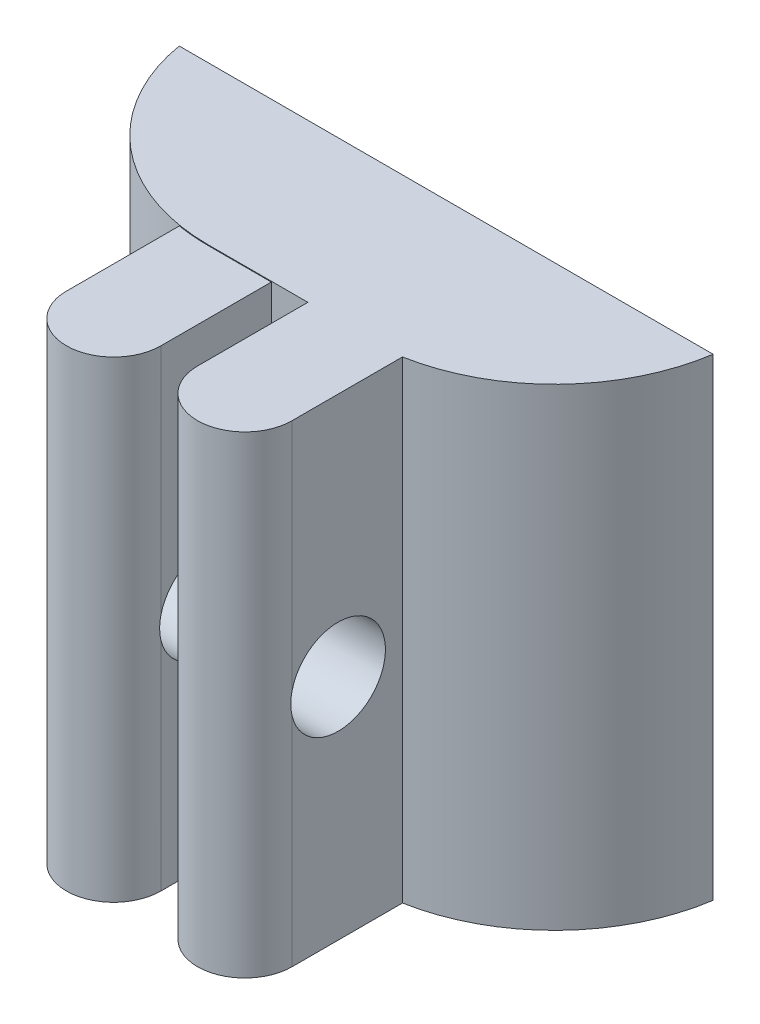
ISO-10303-21;
HEADER;
FILE_DESCRIPTION(('STEP AP214'),'2;1');
FILE_NAME('part.step','',(''),(''),'','','');
FILE_SCHEMA(('AUTOMOTIVE_DESIGN { 1 0 10303 214 1 1 1 1 }'));
ENDSEC;
DATA;
#1=APPLICATION_CONTEXT('core data for automotive mechanical design processes');
#2=APPLICATION_PROTOCOL_DEFINITION('international standard','automotive_design',2000,#1);
#3=PRODUCT_CONTEXT('',#1,'mechanical');
#4=PRODUCT('Part','Part','',(#3));
#5=PRODUCT_RELATED_PRODUCT_CATEGORY('part','',(#4));
#6=PRODUCT_DEFINITION_FORMATION('','',#4);
#7=PRODUCT_DEFINITION_CONTEXT('part definition',#1,'design');
#8=PRODUCT_DEFINITION('design','',#6,#7);
#9=PRODUCT_DEFINITION_SHAPE('','',#8);
#10=(LENGTH_UNIT() NAMED_UNIT(*) SI_UNIT(.MILLI.,.METRE.));
#11=(NAMED_UNIT(*) PLANE_ANGLE_UNIT() SI_UNIT($,.RADIAN.));
#12=(NAMED_UNIT(*) SI_UNIT($,.STERADIAN.) SOLID_ANGLE_UNIT());
#13=UNCERTAINTY_MEASURE_WITH_UNIT(LENGTH_MEASURE(1.E-05),#10,'distance_accuracy_value','');
#14=(GEOMETRIC_REPRESENTATION_CONTEXT(3) GLOBAL_UNCERTAINTY_ASSIGNED_CONTEXT((#13)) GLOBAL_UNIT_ASSIGNED_CONTEXT((#10,
#11,#12)) REPRESENTATION_CONTEXT('',''));
#15=CARTESIAN_POINT('',(0.,0.,0.));
#16=DIRECTION('',(0.,0.,1.));
#17=DIRECTION('',(1.,0.,0.));
#18=AXIS2_PLACEMENT_3D('',#15,#16,#17);
#19=CARTESIAN_POINT('',(-6.42,-15.,8.5));
#20=DIRECTION('',(0.,-1.,0.));
#21=DIRECTION('',(1.,0.,0.));
#22=AXIS2_PLACEMENT_3D('',#19,#20,#21);
#23=CYLINDRICAL_SURFACE('',#22,1.5);
#24=DIRECTION('',(0.,1.,0.));
#25=VECTOR('',#24,1.);
#26=CARTESIAN_POINT('',(-7.92,-15.,8.5));
#27=LINE('',#26,#25);
#28=CARTESIAN_POINT('',(-7.92,-15.,8.5));
#29=VERTEX_POINT('',#28);
#30=CARTESIAN_POINT('',(-7.92,-8.11241498930769,8.5));
#31=VERTEX_POINT('',#30);
#32=EDGE_CURVE('E268',#29,#31,#27,.T.);
#33=ORIENTED_EDGE('',*,*,#32,.F.);
#34=CARTESIAN_POINT('',(-6.42,-15.,8.5));
#35=DIRECTION('',(0.,1.,0.));
#36=DIRECTION('',(-1.,0.,0.));
#37=AXIS2_PLACEMENT_3D('',#34,#35,#36);
#38=CIRCLE('',#37,1.5);
#39=CARTESIAN_POINT('',(-4.92,-15.,8.5));
#40=VERTEX_POINT('',#39);
#41=EDGE_CURVE('E48',#40,#29,#38,.F.);
#42=ORIENTED_EDGE('',*,*,#41,.F.);
#43=DIRECTION('',(0.,1.,0.));
#44=VECTOR('',#43,1.);
#45=CARTESIAN_POINT('',(-4.92,-15.,8.5));
#46=LINE('',#45,#44);
#47=CARTESIAN_POINT('',(-4.92,-8.11241498930769,8.5));
#48=VERTEX_POINT('',#47);
#49=EDGE_CURVE('E275',#48,#40,#46,.F.);
#50=ORIENTED_EDGE('',*,*,#49,.F.);
#51=CARTESIAN_POINT('',(-4.92,-7.41254560298488,8.5));
#52=CARTESIAN_POINT('',(-4.92001371546828,-7.45412724418204,8.50998083315785));
#53=CARTESIAN_POINT('',(-4.9201002060891,-7.49613741775952,8.51817415680516));
#54=CARTESIAN_POINT('',(-4.9203019560262,-7.58070019302562,8.53094623275822));
#55=CARTESIAN_POINT('',(-4.92041721297341,-7.6232527497722,8.53552528259058));
#56=CARTESIAN_POINT('',(-4.92055778771822,-7.70741499094998,8.54095494207867));
#57=CARTESIAN_POINT('',(-4.92058549988733,-7.74901828635982,8.54190496227109));
#58=CARTESIAN_POINT('',(-4.92054226277862,-7.83215876470274,8.54034650872186));
#59=CARTESIAN_POINT('',(-4.9204713169154,-7.8736959498741,8.53783815467585));
#60=CARTESIAN_POINT('',(-4.92028181879158,-7.95642005855864,8.52937975231243));
#61=CARTESIAN_POINT('',(-4.92016326453282,-7.99760696729637,8.52342955953406));
#62=CARTESIAN_POINT('',(-4.92000273049526,-8.07934507147401,8.50812900417141));
#63=CARTESIAN_POINT('',(-4.91996075234869,-8.11989625334496,8.49877856911518));
#64=CARTESIAN_POINT('',(-4.92014167531044,-8.20122206947848,8.47642670475488));
#65=CARTESIAN_POINT('',(-4.92037213747244,-8.24197030682407,8.46332907491474));
#66=CARTESIAN_POINT('',(-4.9213953460393,-8.322200778971,8.43370599562309));
#67=CARTESIAN_POINT('',(-4.92218818592813,-8.36168280214909,8.4171799765941));
#68=CARTESIAN_POINT('',(-4.92340465615959,-8.40037620756465,8.39899318441214));
#69=B_SPLINE_CURVE_WITH_KNOTS('',3,(#51,#52,#53,#54,#55,#56,#57,#58,#59,#60,#61,#62,#63,#64,#65,
#66,#67,#68),.UNSPECIFIED.,.F.,.F.,(4,2,2,2,2,2,2,2,4),(0.,0.128248812008016,0.256487065486652,
0.381186174696836,0.505880968132207,0.630580995641019,0.755283681131896,0.883530080847569,
1.01179780394237),.UNSPECIFIED.);
#70=CARTESIAN_POINT('',(-4.92,-7.41254560298488,8.5));
#71=VERTEX_POINT('',#70);
#72=EDGE_CURVE('E260',#71,#48,#69,.T.);
#73=ORIENTED_EDGE('',*,*,#72,.F.);
#74=DIRECTION('',(0.,1.,0.));
#75=VECTOR('',#74,1.);
#76=CARTESIAN_POINT('',(-4.92,-15.,8.5));
#77=LINE('',#76,#75);
#78=CARTESIAN_POINT('',(-4.92,0.,8.5));
#79=VERTEX_POINT('',#78);
#80=EDGE_CURVE('E277',#79,#71,#77,.F.);
#81=ORIENTED_EDGE('',*,*,#80,.F.);
#82=CARTESIAN_POINT('',(-6.42,0.,8.5));
#83=DIRECTION('',(0.,-1.,0.));
#84=DIRECTION('',(1.,0.,0.));
#85=AXIS2_PLACEMENT_3D('',#82,#83,#84);
#86=CIRCLE('',#85,1.5);
#87=CARTESIAN_POINT('',(-7.92,0.,8.5));
#88=VERTEX_POINT('',#87);
#89=EDGE_CURVE('E11',#88,#79,#86,.F.);
#90=ORIENTED_EDGE('',*,*,#89,.F.);
#91=DIRECTION('',(0.,1.,0.));
#92=VECTOR('',#91,1.);
#93=CARTESIAN_POINT('',(-7.92,-15.,8.5));
#94=LINE('',#93,#92);
#95=CARTESIAN_POINT('',(-7.92,-7.41254560298488,8.5));
#96=VERTEX_POINT('',#95);
#97=EDGE_CURVE('E283',#96,#88,#94,.T.);
#98=ORIENTED_EDGE('',*,*,#97,.F.);
#99=CARTESIAN_POINT('',(-7.92,-8.11241498930769,8.5));
#100=CARTESIAN_POINT('',(-7.91998628453172,-8.07083334811054,8.50998083315785));
#101=CARTESIAN_POINT('',(-7.9198997939109,-8.02882317453306,8.51817415680516));
#102=CARTESIAN_POINT('',(-7.9196980439738,-7.94426039926696,8.53094623275822));
#103=CARTESIAN_POINT('',(-7.91958278702659,-7.90170784252037,8.53552528259058));
#104=CARTESIAN_POINT('',(-7.91944221228178,-7.8175456013426,8.54095494207867));
#105=CARTESIAN_POINT('',(-7.91941450011267,-7.77594230593276,8.54190496227109));
#106=CARTESIAN_POINT('',(-7.91945773722137,-7.69280182758984,8.54034650872186));
#107=CARTESIAN_POINT('',(-7.9195286830846,-7.65126464241848,8.53783815467585));
#108=CARTESIAN_POINT('',(-7.91971818120842,-7.56854053373394,8.52937975231243));
#109=CARTESIAN_POINT('',(-7.91983673546718,-7.52735362499621,8.52342955953406));
#110=CARTESIAN_POINT('',(-7.91999726950474,-7.44561552081858,8.50812900417141));
#111=CARTESIAN_POINT('',(-7.92003924765131,-7.40506433894762,8.49877856911519));
#112=CARTESIAN_POINT('',(-7.91985832468956,-7.3237385228141,8.47642670475488));
#113=CARTESIAN_POINT('',(-7.91962786252755,-7.28299028546851,8.46332907491475));
#114=CARTESIAN_POINT('',(-7.9186046539607,-7.20275981332158,8.4337059956231));
#115=CARTESIAN_POINT('',(-7.91781181407187,-7.16327779014349,8.41717997659411));
#116=CARTESIAN_POINT('',(-7.91659534384041,-7.12458438472793,8.39899318441214));
#117=B_SPLINE_CURVE_WITH_KNOTS('',3,(#99,#100,#101,#102,#103,#104,#105,#106,#107,#108,#109,#110,
#111,#112,#113,#114,#115,#116),.UNSPECIFIED.,.F.,.F.,(4,2,2,2,2,2,2,2,4),(0.,0.128248812008016,
0.25648706548665,0.381186174696835,0.505880968132204,0.630580995641014,0.755283681131891,
0.883530080847564,1.01179780394237),.UNSPECIFIED.);
#118=EDGE_CURVE('E267',#31,#96,#117,.T.);
#119=ORIENTED_EDGE('',*,*,#118,.F.);
#120=EDGE_LOOP('',(#33,#42,#50,#73,#81,#90,#98,#119));
#121=FACE_BOUND('',#120,.T.);
#122=ADVANCED_FACE('F39',(#121),#23,.T.);
#123=CARTESIAN_POINT('',(-10.58,-15.,8.5));
#124=DIRECTION('',(0.,-1.,0.));
#125=DIRECTION('',(1.,0.,0.));
#126=AXIS2_PLACEMENT_3D('',#123,#124,#125);
#127=CYLINDRICAL_SURFACE('',#126,1.5);
#128=DIRECTION('',(0.,1.,0.));
#129=VECTOR('',#128,1.);
#130=CARTESIAN_POINT('',(-12.08,-15.,8.5));
#131=LINE('',#130,#129);
#132=CARTESIAN_POINT('',(-12.08,-15.,8.5));
#133=VERTEX_POINT('',#132);
#134=CARTESIAN_POINT('',(-12.08,-8.11241498930769,8.5));
#135=VERTEX_POINT('',#134);
#136=EDGE_CURVE('E225',#133,#135,#131,.T.);
#137=ORIENTED_EDGE('',*,*,#136,.F.);
#138=CARTESIAN_POINT('',(-10.58,-15.,8.5));
#139=DIRECTION('',(0.,1.,0.));
#140=DIRECTION('',(-1.,0.,0.));
#141=AXIS2_PLACEMENT_3D('',#138,#139,#140);
#142=CIRCLE('',#141,1.5);
#143=CARTESIAN_POINT('',(-9.08,-15.,8.5));
#144=VERTEX_POINT('',#143);
#145=EDGE_CURVE('E319',#144,#133,#142,.F.);
#146=ORIENTED_EDGE('',*,*,#145,.F.);
#147=DIRECTION('',(0.,1.,0.));
#148=VECTOR('',#147,1.);
#149=CARTESIAN_POINT('',(-9.08,-15.,8.5));
#150=LINE('',#149,#148);
#151=CARTESIAN_POINT('',(-9.08,-8.11241498930769,8.5));
#152=VERTEX_POINT('',#151);
#153=EDGE_CURVE('E152',#152,#144,#150,.F.);
#154=ORIENTED_EDGE('',*,*,#153,.F.);
#155=CARTESIAN_POINT('',(-9.08,-7.41254560298488,8.5));
#156=CARTESIAN_POINT('',(-9.08001371546828,-7.45412724418204,8.50998083315785));
#157=CARTESIAN_POINT('',(-9.0801002060891,-7.49613741775952,8.51817415680516));
#158=CARTESIAN_POINT('',(-9.0803019560262,-7.58070019302562,8.53094623275822));
#159=CARTESIAN_POINT('',(-9.08041721297341,-7.6232527497722,8.53552528259058));
#160=CARTESIAN_POINT('',(-9.08055778771822,-7.70741499094998,8.54095494207867));
#161=CARTESIAN_POINT('',(-9.08058549988733,-7.74901828635982,8.54190496227109));
#162=CARTESIAN_POINT('',(-9.08054226277862,-7.83215876470274,8.54034650872186));
#163=CARTESIAN_POINT('',(-9.0804713169154,-7.8736959498741,8.53783815467585));
#164=CARTESIAN_POINT('',(-9.08028181879158,-7.95642005855864,8.52937975231243));
#165=CARTESIAN_POINT('',(-9.08016326453282,-7.99760696729637,8.52342955953406));
#166=CARTESIAN_POINT('',(-9.08000273049526,-8.07934507147401,8.50812900417141));
#167=CARTESIAN_POINT('',(-9.07996075234869,-8.11989625334496,8.49877856911518));
#168=CARTESIAN_POINT('',(-9.08014167531044,-8.20122206947848,8.47642670475488));
#169=CARTESIAN_POINT('',(-9.08037213747244,-8.24197030682407,8.46332907491474));
#170=CARTESIAN_POINT('',(-9.0813953460393,-8.322200778971,8.43370599562309));
#171=CARTESIAN_POINT('',(-9.08218818592813,-8.36168280214909,8.4171799765941));
#172=CARTESIAN_POINT('',(-9.08340465615959,-8.40037620756465,8.39899318441214));
#173=B_SPLINE_CURVE_WITH_KNOTS('',3,(#155,#156,#157,#158,#159,#160,#161,#162,#163,#164,#165,
#166,#167,#168,#169,#170,#171,#172),.UNSPECIFIED.,.F.,.F.,(4,2,2,2,2,2,2,2,4),(0.,
0.128248812008016,0.256487065486652,0.381186174696836,0.505880968132207,0.630580995641019,
0.755283681131896,0.883530080847569,1.01179780394237),.UNSPECIFIED.);
#174=CARTESIAN_POINT('',(-9.08,-7.41254560298488,8.5));
#175=VERTEX_POINT('',#174);
#176=EDGE_CURVE('E228',#175,#152,#173,.T.);
#177=ORIENTED_EDGE('',*,*,#176,.F.);
#178=DIRECTION('',(0.,1.,0.));
#179=VECTOR('',#178,1.);
#180=CARTESIAN_POINT('',(-9.08,-15.,8.5));
#181=LINE('',#180,#179);
#182=CARTESIAN_POINT('',(-9.08,-0.0236385703848998,8.5));
#183=VERTEX_POINT('',#182);
#184=EDGE_CURVE('E318',#183,#175,#181,.F.);
#185=ORIENTED_EDGE('',*,*,#184,.F.);
#186=CARTESIAN_POINT('',(-10.58,-0.0236385703849002,8.5));
#187=DIRECTION('',(0.,-1.,0.));
#188=DIRECTION('',(1.,0.,0.));
#189=AXIS2_PLACEMENT_3D('',#186,#187,#188);
#190=CIRCLE('',#189,1.5);
#191=CARTESIAN_POINT('',(-12.08,-0.0236385703848998,8.5));
#192=VERTEX_POINT('',#191);
#193=EDGE_CURVE('E299',#192,#183,#190,.F.);
#194=ORIENTED_EDGE('',*,*,#193,.F.);
#195=DIRECTION('',(0.,1.,0.));
#196=VECTOR('',#195,1.);
#197=CARTESIAN_POINT('',(-12.08,-15.,8.5));
#198=LINE('',#197,#196);
#199=CARTESIAN_POINT('',(-12.08,-7.41254560298488,8.5));
#200=VERTEX_POINT('',#199);
#201=EDGE_CURVE('E222',#200,#192,#198,.T.);
#202=ORIENTED_EDGE('',*,*,#201,.F.);
#203=CARTESIAN_POINT('',(-12.08,-8.11241498930769,8.5));
#204=CARTESIAN_POINT('',(-12.0799862845317,-8.07083334811054,8.50998083315785));
#205=CARTESIAN_POINT('',(-12.0798997939109,-8.02882317453306,8.51817415680516));
#206=CARTESIAN_POINT('',(-12.0796980439738,-7.94426039926696,8.53094623275822));
#207=CARTESIAN_POINT('',(-12.0795827870266,-7.90170784252037,8.53552528259058));
#208=CARTESIAN_POINT('',(-12.0794422122818,-7.8175456013426,8.54095494207867));
#209=CARTESIAN_POINT('',(-12.0794145001127,-7.77594230593276,8.54190496227109));
#210=CARTESIAN_POINT('',(-12.0794577372214,-7.69280182758984,8.54034650872186));
#211=CARTESIAN_POINT('',(-12.0795286830846,-7.65126464241848,8.53783815467585));
#212=CARTESIAN_POINT('',(-12.0797181812084,-7.56854053373394,8.52937975231243));
#213=CARTESIAN_POINT('',(-12.0798367354672,-7.52735362499621,8.52342955953406));
#214=CARTESIAN_POINT('',(-12.0799972695047,-7.44561552081858,8.50812900417141));
#215=CARTESIAN_POINT('',(-12.0800392476513,-7.40506433894762,8.49877856911519));
#216=CARTESIAN_POINT('',(-12.0798583246896,-7.3237385228141,8.47642670475488));
#217=CARTESIAN_POINT('',(-12.0796278625276,-7.28299028546851,8.46332907491475));
#218=CARTESIAN_POINT('',(-12.0786046539607,-7.20275981332158,8.4337059956231));
#219=CARTESIAN_POINT('',(-12.0778118140719,-7.16327779014349,8.41717997659411));
#220=CARTESIAN_POINT('',(-12.0765953438404,-7.12458438472793,8.39899318441214));
#221=B_SPLINE_CURVE_WITH_KNOTS('',3,(#203,#204,#205,#206,#207,#208,#209,#210,#211,#212,#213,
#214,#215,#216,#217,#218,#219,#220),.UNSPECIFIED.,.F.,.F.,(4,2,2,2,2,2,2,2,4),(0.,
0.128248812008016,0.25648706548665,0.381186174696835,0.505880968132204,0.630580995641014,
0.755283681131891,0.883530080847564,1.01179780394237),.UNSPECIFIED.);
#222=EDGE_CURVE('E236',#135,#200,#221,.T.);
#223=ORIENTED_EDGE('',*,*,#222,.F.);
#224=EDGE_LOOP('',(#137,#146,#154,#177,#185,#194,#202,#223));
#225=FACE_BOUND('',#224,.T.);
#226=ADVANCED_FACE('F243',(#225),#127,.T.);
#227=CARTESIAN_POINT('',(0.,0.,5.));
#228=DIRECTION('',(0.,0.,-1.));
#229=DIRECTION('',(-1.,0.,0.));
#230=AXIS2_PLACEMENT_3D('',#227,#228,#229);
#231=PLANE('',#230);
#232=DIRECTION('',(-1.,0.,0.));
#233=VECTOR('',#232,1.);
#234=CARTESIAN_POINT('',(0.,0.,5.));
#235=LINE('',#234,#233);
#236=CARTESIAN_POINT('',(-7.92,0.,5.));
#237=VERTEX_POINT('',#236);
#238=CARTESIAN_POINT('',(-11.0839202169004,0.,5.));
#239=VERTEX_POINT('',#238);
#240=EDGE_CURVE('E167',#237,#239,#235,.T.);
#241=ORIENTED_EDGE('',*,*,#240,.T.);
#242=DIRECTION('',(0.,1.,0.));
#243=VECTOR('',#242,1.);
#244=CARTESIAN_POINT('',(-11.0839202169004,0.,5.));
#245=LINE('',#244,#243);
#246=CARTESIAN_POINT('',(-11.0839202169004,-0.0236385703848998,5.));
#247=VERTEX_POINT('',#246);
#248=EDGE_CURVE('E214',#239,#247,#245,.F.);
#249=ORIENTED_EDGE('',*,*,#248,.T.);
#250=DIRECTION('',(-1.,0.,0.));
#251=VECTOR('',#250,1.);
#252=CARTESIAN_POINT('',(-12.08,-0.0236385703848998,5.));
#253=LINE('',#252,#251);
#254=CARTESIAN_POINT('',(-9.08,-0.0236385703848998,5.));
#255=VERTEX_POINT('',#254);
#256=EDGE_CURVE('E174',#255,#247,#253,.T.);
#257=ORIENTED_EDGE('',*,*,#256,.F.);
#258=DIRECTION('',(0.,1.,0.));
#259=VECTOR('',#258,1.);
#260=CARTESIAN_POINT('',(-9.08,-0.0236385703848998,5.));
#261=LINE('',#260,#259);
#262=CARTESIAN_POINT('',(-9.08,-15.,5.));
#263=VERTEX_POINT('',#262);
#264=EDGE_CURVE('E150',#263,#255,#261,.T.);
#265=ORIENTED_EDGE('',*,*,#264,.F.);
#266=DIRECTION('',(1.,0.,0.));
#267=VECTOR('',#266,1.);
#268=CARTESIAN_POINT('',(0.,-15.,5.));
#269=LINE('',#268,#267);
#270=CARTESIAN_POINT('',(-7.92,-15.,5.));
#271=VERTEX_POINT('',#270);
#272=EDGE_CURVE('E158',#263,#271,#269,.T.);
#273=ORIENTED_EDGE('',*,*,#272,.T.);
#274=DIRECTION('',(0.,-1.,0.));
#275=VECTOR('',#274,1.);
#276=CARTESIAN_POINT('',(-7.92,0.,5.));
#277=LINE('',#276,#275);
#278=EDGE_CURVE('E175',#237,#271,#277,.T.);
#279=ORIENTED_EDGE('',*,*,#278,.F.);
#280=EDGE_LOOP('',(#241,#249,#257,#265,#273,#279));
#281=FACE_BOUND('',#280,.T.);
#282=ADVANCED_FACE('F171',(#281),#231,.F.);
#283=CARTESIAN_POINT('',(0.,0.,5.));
#284=DIRECTION('',(0.,-1.,0.));
#285=DIRECTION('',(1.,0.,0.));
#286=AXIS2_PLACEMENT_3D('',#283,#284,#285);
#287=PLANE('',#286);
#288=DIRECTION('',(0.,0.,-1.));
#289=VECTOR('',#288,1.);
#290=CARTESIAN_POINT('',(-7.92,0.,10.));
#291=LINE('',#290,#289);
#292=EDGE_CURVE('E185',#88,#237,#291,.T.);
#293=ORIENTED_EDGE('',*,*,#292,.F.);
#294=ORIENTED_EDGE('',*,*,#89,.T.);
#295=DIRECTION('',(0.,0.,-1.));
#296=VECTOR('',#295,1.);
#297=CARTESIAN_POINT('',(-4.92,0.,10.));
#298=LINE('',#297,#296);
#299=CARTESIAN_POINT('',(-4.92,0.,5.));
#300=VERTEX_POINT('',#299);
#301=EDGE_CURVE('E187',#79,#300,#298,.T.);
#302=ORIENTED_EDGE('',*,*,#301,.T.);
#303=CARTESIAN_POINT('',(-6.,0.,-0.90199966113181));
#304=DIRECTION('',(0.,-1.,0.));
#305=DIRECTION('',(1.,0.,0.));
#306=AXIS2_PLACEMENT_3D('',#303,#304,#305);
#307=CIRCLE('',#306,6.);
#308=CARTESIAN_POINT('',(-0.0681877464540313,0.,0.));
#309=VERTEX_POINT('',#308);
#310=EDGE_CURVE('E205',#300,#309,#307,.F.);
#311=ORIENTED_EDGE('',*,*,#310,.T.);
#312=DIRECTION('',(-1.,0.,0.));
#313=VECTOR('',#312,1.);
#314=CARTESIAN_POINT('',(0.,0.,0.));
#315=LINE('',#314,#313);
#316=CARTESIAN_POINT('',(-17.,0.,0.));
#317=VERTEX_POINT('',#316);
#318=EDGE_CURVE('E192',#309,#317,#315,.T.);
#319=ORIENTED_EDGE('',*,*,#318,.T.);
#320=CARTESIAN_POINT('',(-11.0839202169004,0.,-1.));
#321=DIRECTION('',(0.,-1.,0.));
#322=DIRECTION('',(1.,0.,0.));
#323=AXIS2_PLACEMENT_3D('',#320,#321,#322);
#324=CIRCLE('',#323,6.);
#325=EDGE_CURVE('E166',#317,#239,#324,.F.);
#326=ORIENTED_EDGE('',*,*,#325,.T.);
#327=ORIENTED_EDGE('',*,*,#240,.F.);
#328=EDGE_LOOP('',(#293,#294,#302,#311,#319,#326,#327));
#329=FACE_BOUND('',#328,.T.);
#330=ADVANCED_FACE('F288',(#329),#287,.F.);
#331=CARTESIAN_POINT('',(0.,-15.,5.));
#332=DIRECTION('',(0.,1.,0.));
#333=DIRECTION('',(-1.,0.,0.));
#334=AXIS2_PLACEMENT_3D('',#331,#332,#333);
#335=PLANE('',#334);
#336=DIRECTION('',(0.,0.,-1.));
#337=VECTOR('',#336,1.);
#338=CARTESIAN_POINT('',(-4.92,-15.,10.));
#339=LINE('',#338,#337);
#340=CARTESIAN_POINT('',(-4.92,-15.,5.));
#341=VERTEX_POINT('',#340);
#342=EDGE_CURVE('E189',#40,#341,#339,.T.);
#343=ORIENTED_EDGE('',*,*,#342,.F.);
#344=ORIENTED_EDGE('',*,*,#41,.T.);
#345=DIRECTION('',(0.,0.,-1.));
#346=VECTOR('',#345,1.);
#347=CARTESIAN_POINT('',(-7.92,-15.,10.));
#348=LINE('',#347,#346);
#349=EDGE_CURVE('E162',#29,#271,#348,.T.);
#350=ORIENTED_EDGE('',*,*,#349,.T.);
#351=ORIENTED_EDGE('',*,*,#272,.F.);
#352=DIRECTION('',(0.,0.,-1.));
#353=VECTOR('',#352,1.);
#354=CARTESIAN_POINT('',(-9.08,-15.,10.));
#355=LINE('',#354,#353);
#356=EDGE_CURVE('E145',#144,#263,#355,.T.);
#357=ORIENTED_EDGE('',*,*,#356,.F.);
#358=ORIENTED_EDGE('',*,*,#145,.T.);
#359=DIRECTION('',(0.,0.,-1.));
#360=VECTOR('',#359,1.);
#361=CARTESIAN_POINT('',(-12.08,-15.,10.));
#362=LINE('',#361,#360);
#363=CARTESIAN_POINT('',(-12.08,-15.,4.91674108489633));
#364=VERTEX_POINT('',#363);
#365=EDGE_CURVE('E155',#133,#364,#362,.T.);
#366=ORIENTED_EDGE('',*,*,#365,.T.);
#367=CARTESIAN_POINT('',(-11.0839202169004,-15.,-1.));
#368=DIRECTION('',(0.,1.,0.));
#369=DIRECTION('',(-1.,0.,0.));
#370=AXIS2_PLACEMENT_3D('',#367,#368,#369);
#371=CIRCLE('',#370,6.);
#372=CARTESIAN_POINT('',(-17.,-15.,0.));
#373=VERTEX_POINT('',#372);
#374=EDGE_CURVE('E209',#364,#373,#371,.F.);
#375=ORIENTED_EDGE('',*,*,#374,.T.);
#376=DIRECTION('',(1.,0.,0.));
#377=VECTOR('',#376,1.);
#378=CARTESIAN_POINT('',(0.,-15.,0.));
#379=LINE('',#378,#377);
#380=CARTESIAN_POINT('',(-0.0681877464540305,-15.,0.));
#381=VERTEX_POINT('',#380);
#382=EDGE_CURVE('E193',#373,#381,#379,.T.);
#383=ORIENTED_EDGE('',*,*,#382,.T.);
#384=CARTESIAN_POINT('',(-6.,-15.,-0.90199966113181));
#385=DIRECTION('',(0.,1.,0.));
#386=DIRECTION('',(-1.,0.,0.));
#387=AXIS2_PLACEMENT_3D('',#384,#385,#386);
#388=CIRCLE('',#387,6.);
#389=EDGE_CURVE('E211',#381,#341,#388,.F.);
#390=ORIENTED_EDGE('',*,*,#389,.T.);
#391=EDGE_LOOP('',(#343,#344,#350,#351,#357,#358,#366,#375,#383,#390));
#392=FACE_BOUND('',#391,.T.);
#393=ADVANCED_FACE('F160',(#392),#335,.F.);
#394=CARTESIAN_POINT('',(0.,0.,0.));
#395=DIRECTION('',(0.,0.,-1.));
#396=DIRECTION('',(-1.,0.,0.));
#397=AXIS2_PLACEMENT_3D('',#394,#395,#396);
#398=PLANE('',#397);
#399=ORIENTED_EDGE('',*,*,#318,.F.);
#400=DIRECTION('',(0.,1.,0.));
#401=VECTOR('',#400,1.);
#402=CARTESIAN_POINT('',(-0.0681877464540313,-7.5,0.));
#403=LINE('',#402,#401);
#404=EDGE_CURVE('E207',#309,#381,#403,.F.);
#405=ORIENTED_EDGE('',*,*,#404,.T.);
#406=ORIENTED_EDGE('',*,*,#382,.F.);
#407=DIRECTION('',(0.,-1.,0.));
#408=VECTOR('',#407,1.);
#409=CARTESIAN_POINT('',(-17.,0.,0.));
#410=LINE('',#409,#408);
#411=EDGE_CURVE('E196',#317,#373,#410,.T.);
#412=ORIENTED_EDGE('',*,*,#411,.F.);
#413=EDGE_LOOP('',(#399,#405,#406,#412));
#414=FACE_BOUND('',#413,.T.);
#415=ADVANCED_FACE('F345',(#414),#398,.T.);
#416=CARTESIAN_POINT('',(-7.92,0.,10.));
#417=DIRECTION('',(1.,0.,0.));
#418=DIRECTION('',(0.,1.,0.));
#419=AXIS2_PLACEMENT_3D('',#416,#417,#418);
#420=PLANE('',#419);
#421=ORIENTED_EDGE('',*,*,#349,.F.);
#422=ORIENTED_EDGE('',*,*,#32,.T.);
#423=CARTESIAN_POINT('',(-7.92,-7.76248029614629,7.04138911613754));
#424=DIRECTION('',(1.,0.,0.));
#425=DIRECTION('',(0.,1.,0.));
#426=AXIS2_PLACEMENT_3D('',#423,#424,#425);
#427=CIRCLE('',#426,1.5);
#428=EDGE_CURVE('E304',#31,#96,#427,.T.);
#429=ORIENTED_EDGE('',*,*,#428,.T.);
#430=ORIENTED_EDGE('',*,*,#97,.T.);
#431=ORIENTED_EDGE('',*,*,#292,.T.);
#432=ORIENTED_EDGE('',*,*,#278,.T.);
#433=EDGE_LOOP('',(#421,#422,#429,#430,#431,#432));
#434=FACE_BOUND('',#433,.T.);
#435=ADVANCED_FACE('F284',(#434),#420,.F.);
#436=CARTESIAN_POINT('',(-4.92,0.,10.));
#437=DIRECTION('',(-1.,0.,0.));
#438=DIRECTION('',(0.,-1.,0.));
#439=AXIS2_PLACEMENT_3D('',#436,#437,#438);
#440=PLANE('',#439);
#441=ORIENTED_EDGE('',*,*,#301,.F.);
#442=ORIENTED_EDGE('',*,*,#80,.T.);
#443=CARTESIAN_POINT('',(-4.92,-7.76248029614629,7.04138911613754));
#444=DIRECTION('',(-1.,0.,0.));
#445=DIRECTION('',(0.,-1.,0.));
#446=AXIS2_PLACEMENT_3D('',#443,#444,#445);
#447=CIRCLE('',#446,1.5);
#448=EDGE_CURVE('E306',#71,#48,#447,.T.);
#449=ORIENTED_EDGE('',*,*,#448,.T.);
#450=ORIENTED_EDGE('',*,*,#49,.T.);
#451=ORIENTED_EDGE('',*,*,#342,.T.);
#452=DIRECTION('',(0.,1.,0.));
#453=VECTOR('',#452,1.);
#454=CARTESIAN_POINT('',(-4.92,0.,5.));
#455=LINE('',#454,#453);
#456=EDGE_CURVE('E177',#341,#300,#455,.T.);
#457=ORIENTED_EDGE('',*,*,#456,.T.);
#458=EDGE_LOOP('',(#441,#442,#449,#450,#451,#457));
#459=FACE_BOUND('',#458,.T.);
#460=ADVANCED_FACE('F372',(#459),#440,.F.);
#461=CARTESIAN_POINT('',(-12.08,-0.0236385703848998,10.));
#462=DIRECTION('',(1.,0.,0.));
#463=DIRECTION('',(0.,1.,0.));
#464=AXIS2_PLACEMENT_3D('',#461,#462,#463);
#465=PLANE('',#464);
#466=ORIENTED_EDGE('',*,*,#365,.F.);
#467=ORIENTED_EDGE('',*,*,#136,.T.);
#468=CARTESIAN_POINT('',(-12.08,-7.76248029614629,7.04138911613754));
#469=DIRECTION('',(1.,0.,0.));
#470=DIRECTION('',(0.,1.,0.));
#471=AXIS2_PLACEMENT_3D('',#468,#469,#470);
#472=CIRCLE('',#471,1.5);
#473=EDGE_CURVE('E203',#135,#200,#472,.T.);
#474=ORIENTED_EDGE('',*,*,#473,.T.);
#475=ORIENTED_EDGE('',*,*,#201,.T.);
#476=DIRECTION('',(0.,0.,-1.));
#477=VECTOR('',#476,1.);
#478=CARTESIAN_POINT('',(-12.08,-0.0236385703848998,10.));
#479=LINE('',#478,#477);
#480=CARTESIAN_POINT('',(-12.08,-0.0236385703848998,4.91674108489633));
#481=VERTEX_POINT('',#480);
#482=EDGE_CURVE('E179',#192,#481,#479,.T.);
#483=ORIENTED_EDGE('',*,*,#482,.T.);
#484=DIRECTION('',(0.,1.,0.));
#485=VECTOR('',#484,1.);
#486=CARTESIAN_POINT('',(-12.08,-0.0236385703848998,4.91674108489633));
#487=LINE('',#486,#485);
#488=EDGE_CURVE('E219',#481,#364,#487,.F.);
#489=ORIENTED_EDGE('',*,*,#488,.T.);
#490=EDGE_LOOP('',(#466,#467,#474,#475,#483,#489));
#491=FACE_BOUND('',#490,.T.);
#492=ADVANCED_FACE('F253',(#491),#465,.F.);
#493=CARTESIAN_POINT('',(-9.08,-0.0236385703848998,10.));
#494=DIRECTION('',(-1.,0.,0.));
#495=DIRECTION('',(0.,-1.,0.));
#496=AXIS2_PLACEMENT_3D('',#493,#494,#495);
#497=PLANE('',#496);
#498=DIRECTION('',(0.,0.,-1.));
#499=VECTOR('',#498,1.);
#500=CARTESIAN_POINT('',(-9.08,-0.0236385703848998,10.));
#501=LINE('',#500,#499);
#502=EDGE_CURVE('E154',#183,#255,#501,.T.);
#503=ORIENTED_EDGE('',*,*,#502,.F.);
#504=ORIENTED_EDGE('',*,*,#184,.T.);
#505=CARTESIAN_POINT('',(-9.08,-7.76248029614629,7.04138911613754));
#506=DIRECTION('',(-1.,0.,0.));
#507=DIRECTION('',(0.,-1.,0.));
#508=AXIS2_PLACEMENT_3D('',#505,#506,#507);
#509=CIRCLE('',#508,1.5);
#510=EDGE_CURVE('E201',#175,#152,#509,.T.);
#511=ORIENTED_EDGE('',*,*,#510,.T.);
#512=ORIENTED_EDGE('',*,*,#153,.T.);
#513=ORIENTED_EDGE('',*,*,#356,.T.);
#514=ORIENTED_EDGE('',*,*,#264,.T.);
#515=EDGE_LOOP('',(#503,#504,#511,#512,#513,#514));
#516=FACE_BOUND('',#515,.T.);
#517=ADVANCED_FACE('F148',(#516),#497,.F.);
#518=CARTESIAN_POINT('',(-12.08,-0.0236385703848998,10.));
#519=DIRECTION('',(0.,-1.,0.));
#520=DIRECTION('',(1.,0.,0.));
#521=AXIS2_PLACEMENT_3D('',#518,#519,#520);
#522=PLANE('',#521);
#523=ORIENTED_EDGE('',*,*,#482,.F.);
#524=ORIENTED_EDGE('',*,*,#193,.T.);
#525=ORIENTED_EDGE('',*,*,#502,.T.);
#526=ORIENTED_EDGE('',*,*,#256,.T.);
#527=CARTESIAN_POINT('',(-11.0839202169004,-0.0236385703848998,-1.));
#528=DIRECTION('',(0.,-1.,0.));
#529=DIRECTION('',(1.,0.,0.));
#530=AXIS2_PLACEMENT_3D('',#527,#528,#529);
#531=CIRCLE('',#530,6.);
#532=EDGE_CURVE('E216',#247,#481,#531,.T.);
#533=ORIENTED_EDGE('',*,*,#532,.T.);
#534=EDGE_LOOP('',(#523,#524,#525,#526,#533));
#535=FACE_BOUND('',#534,.T.);
#536=ADVANCED_FACE('F298',(#535),#522,.F.);
#537=CARTESIAN_POINT('',(-17.,-7.76248029614629,7.04138911613754));
#538=DIRECTION('',(1.,0.,0.));
#539=DIRECTION('',(0.,0.,-1.));
#540=AXIS2_PLACEMENT_3D('',#537,#538,#539);
#541=CYLINDRICAL_SURFACE('',#540,1.5);
#542=ORIENTED_EDGE('',*,*,#510,.F.);
#543=ORIENTED_EDGE('',*,*,#176,.T.);
#544=EDGE_LOOP('',(#542,#543));
#545=FACE_BOUND('',#544,.T.);
#546=ORIENTED_EDGE('',*,*,#473,.F.);
#547=ORIENTED_EDGE('',*,*,#222,.T.);
#548=EDGE_LOOP('',(#546,#547));
#549=FACE_BOUND('',#548,.T.);
#550=ADVANCED_FACE('F251',(#545,#549),#541,.F.);
#551=ORIENTED_EDGE('',*,*,#448,.F.);
#552=ORIENTED_EDGE('',*,*,#72,.T.);
#553=EDGE_LOOP('',(#551,#552));
#554=FACE_BOUND('',#553,.T.);
#555=ORIENTED_EDGE('',*,*,#428,.F.);
#556=ORIENTED_EDGE('',*,*,#118,.T.);
#557=EDGE_LOOP('',(#555,#556));
#558=FACE_BOUND('',#557,.T.);
#559=ADVANCED_FACE('F246',(#554,#558),#541,.F.);
#560=CARTESIAN_POINT('',(-6.,0.,-0.90199966113181));
#561=DIRECTION('',(0.,1.,0.));
#562=DIRECTION('',(-1.,0.,0.));
#563=AXIS2_PLACEMENT_3D('',#560,#561,#562);
#564=CYLINDRICAL_SURFACE('',#563,6.);
#565=ORIENTED_EDGE('',*,*,#389,.F.);
#566=ORIENTED_EDGE('',*,*,#404,.F.);
#567=ORIENTED_EDGE('',*,*,#310,.F.);
#568=ORIENTED_EDGE('',*,*,#456,.F.);
#569=EDGE_LOOP('',(#565,#566,#567,#568));
#570=FACE_BOUND('',#569,.T.);
#571=ADVANCED_FACE('F250',(#570),#564,.T.);
#572=CARTESIAN_POINT('',(-11.0839202169004,0.,-1.));
#573=DIRECTION('',(0.,1.,0.));
#574=DIRECTION('',(0.,0.,1.));
#575=AXIS2_PLACEMENT_3D('',#572,#573,#574);
#576=CYLINDRICAL_SURFACE('',#575,6.);
#577=ORIENTED_EDGE('',*,*,#325,.F.);
#578=ORIENTED_EDGE('',*,*,#411,.T.);
#579=ORIENTED_EDGE('',*,*,#374,.F.);
#580=ORIENTED_EDGE('',*,*,#488,.F.);
#581=ORIENTED_EDGE('',*,*,#532,.F.);
#582=ORIENTED_EDGE('',*,*,#248,.F.);
#583=EDGE_LOOP('',(#577,#578,#579,#580,#581,#582));
#584=FACE_BOUND('',#583,.T.);
#585=ADVANCED_FACE('F293',(#584),#576,.T.);
#586=CLOSED_SHELL('',(#122,#226,#282,#330,#393,#415,#435,#460,#492,#517,#536,#550,#559,#571,#585));
#587=MANIFOLD_SOLID_BREP('B2',#586);
#588=ADVANCED_BREP_SHAPE_REPRESENTATION('',(#18,#587),#14);
#589=SHAPE_DEFINITION_REPRESENTATION(#9,#588);
ENDSEC;
END-ISO-10303-21;
